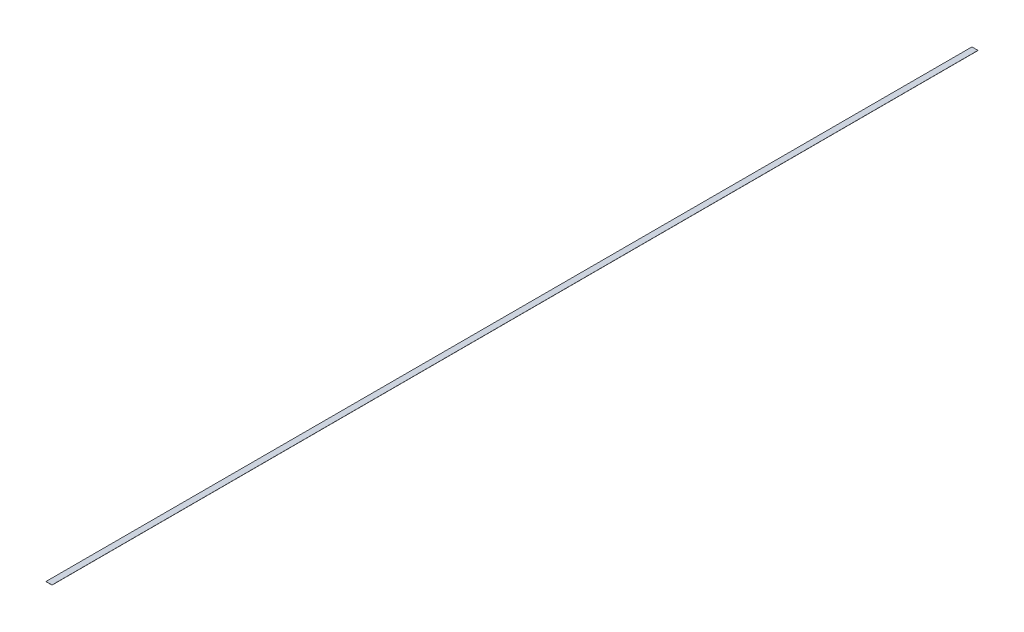
ISO-10303-21;
HEADER;
FILE_DESCRIPTION(('STEP AP214'),'2;1');
FILE_NAME('part.step','',(''),(''),'','','');
FILE_SCHEMA(('AUTOMOTIVE_DESIGN { 1 0 10303 214 1 1 1 1 }'));
ENDSEC;
DATA;
#1=APPLICATION_CONTEXT('core data for automotive mechanical design processes');
#2=APPLICATION_PROTOCOL_DEFINITION('international standard','automotive_design',2000,#1);
#3=PRODUCT_CONTEXT('',#1,'mechanical');
#4=PRODUCT('Part','Part','',(#3));
#5=PRODUCT_RELATED_PRODUCT_CATEGORY('part','',(#4));
#6=PRODUCT_DEFINITION_FORMATION('','',#4);
#7=PRODUCT_DEFINITION_CONTEXT('part definition',#1,'design');
#8=PRODUCT_DEFINITION('design','',#6,#7);
#9=PRODUCT_DEFINITION_SHAPE('','',#8);
#10=(LENGTH_UNIT() NAMED_UNIT(*) SI_UNIT(.MILLI.,.METRE.));
#11=(NAMED_UNIT(*) PLANE_ANGLE_UNIT() SI_UNIT($,.RADIAN.));
#12=(NAMED_UNIT(*) SI_UNIT($,.STERADIAN.) SOLID_ANGLE_UNIT());
#13=UNCERTAINTY_MEASURE_WITH_UNIT(LENGTH_MEASURE(1.E-05),#10,'distance_accuracy_value','');
#14=(GEOMETRIC_REPRESENTATION_CONTEXT(3) GLOBAL_UNCERTAINTY_ASSIGNED_CONTEXT((#13)) GLOBAL_UNIT_ASSIGNED_CONTEXT((#10,
#11,#12)) REPRESENTATION_CONTEXT('',''));
#15=CARTESIAN_POINT('',(0.,0.,0.));
#16=DIRECTION('',(0.,0.,1.));
#17=DIRECTION('',(1.,0.,0.));
#18=AXIS2_PLACEMENT_3D('',#15,#16,#17);
#19=CARTESIAN_POINT('',(0.,0.,0.));
#20=DIRECTION('',(0.,1.,0.));
#21=DIRECTION('',(0.,0.,1.));
#22=AXIS2_PLACEMENT_3D('',#19,#20,#21);
#23=PLANE('',#22);
#24=DIRECTION('',(1.,0.,0.));
#25=VECTOR('',#24,1.);
#26=CARTESIAN_POINT('',(0.,0.,3886.2));
#27=LINE('',#26,#25);
#28=CARTESIAN_POINT('',(-25.4,0.,3886.2));
#29=VERTEX_POINT('',#28);
#30=CARTESIAN_POINT('',(25.4,0.,3886.2));
#31=VERTEX_POINT('',#30);
#32=EDGE_CURVE('E109',#29,#31,#27,.T.);
#33=ORIENTED_EDGE('',*,*,#32,.F.);
#34=DIRECTION('',(0.,0.,-1.));
#35=VECTOR('',#34,1.);
#36=CARTESIAN_POINT('',(-25.4,0.,0.));
#37=LINE('',#36,#35);
#38=CARTESIAN_POINT('',(-25.4,0.,-3886.2));
#39=VERTEX_POINT('',#38);
#40=EDGE_CURVE('E104',#29,#39,#37,.T.);
#41=ORIENTED_EDGE('',*,*,#40,.T.);
#42=DIRECTION('',(1.,0.,0.));
#43=VECTOR('',#42,1.);
#44=CARTESIAN_POINT('',(-25.4,0.,-3886.2));
#45=LINE('',#44,#43);
#46=CARTESIAN_POINT('',(25.4,0.,-3886.2));
#47=VERTEX_POINT('',#46);
#48=EDGE_CURVE('E107',#39,#47,#45,.T.);
#49=ORIENTED_EDGE('',*,*,#48,.T.);
#50=DIRECTION('',(0.,0.,-1.));
#51=VECTOR('',#50,1.);
#52=CARTESIAN_POINT('',(25.4,0.,0.));
#53=LINE('',#52,#51);
#54=EDGE_CURVE('E98',#31,#47,#53,.T.);
#55=ORIENTED_EDGE('',*,*,#54,.F.);
#56=EDGE_LOOP('',(#33,#41,#49,#55));
#57=FACE_BOUND('',#56,.T.);
#58=ADVANCED_FACE('F62',(#57),#23,.F.);
#59=CARTESIAN_POINT('',(25.4,1.27,0.));
#60=DIRECTION('',(-1.,0.,0.));
#61=DIRECTION('',(0.,0.,1.));
#62=AXIS2_PLACEMENT_3D('',#59,#60,#61);
#63=PLANE('',#62);
#64=ORIENTED_EDGE('',*,*,#54,.T.);
#65=DIRECTION('',(0.,-1.,0.));
#66=VECTOR('',#65,1.);
#67=CARTESIAN_POINT('',(25.4,1.27,-3886.2));
#68=LINE('',#67,#66);
#69=CARTESIAN_POINT('',(25.4,1.27,-3886.2));
#70=VERTEX_POINT('',#69);
#71=EDGE_CURVE('E66',#70,#47,#68,.T.);
#72=ORIENTED_EDGE('',*,*,#71,.F.);
#73=DIRECTION('',(0.,0.,-1.));
#74=VECTOR('',#73,1.);
#75=CARTESIAN_POINT('',(25.4,1.27,0.));
#76=LINE('',#75,#74);
#77=CARTESIAN_POINT('',(25.4,1.27,3886.2));
#78=VERTEX_POINT('',#77);
#79=EDGE_CURVE('E128',#78,#70,#76,.T.);
#80=ORIENTED_EDGE('',*,*,#79,.F.);
#81=DIRECTION('',(0.,-1.,0.));
#82=VECTOR('',#81,1.);
#83=CARTESIAN_POINT('',(25.4,1.27,3886.2));
#84=LINE('',#83,#82);
#85=EDGE_CURVE('E12',#78,#31,#84,.T.);
#86=ORIENTED_EDGE('',*,*,#85,.T.);
#87=EDGE_LOOP('',(#64,#72,#80,#86));
#88=FACE_BOUND('',#87,.T.);
#89=ADVANCED_FACE('F136',(#88),#63,.F.);
#90=CARTESIAN_POINT('',(0.,1.27,3886.2));
#91=DIRECTION('',(0.,0.,-1.));
#92=DIRECTION('',(-1.,0.,0.));
#93=AXIS2_PLACEMENT_3D('',#90,#91,#92);
#94=PLANE('',#93);
#95=ORIENTED_EDGE('',*,*,#32,.T.);
#96=ORIENTED_EDGE('',*,*,#85,.F.);
#97=DIRECTION('',(1.,0.,0.));
#98=VECTOR('',#97,1.);
#99=CARTESIAN_POINT('',(0.,1.27,3886.2));
#100=LINE('',#99,#98);
#101=CARTESIAN_POINT('',(-25.4,1.27,3886.2));
#102=VERTEX_POINT('',#101);
#103=EDGE_CURVE('E110',#102,#78,#100,.T.);
#104=ORIENTED_EDGE('',*,*,#103,.F.);
#105=DIRECTION('',(0.,-1.,0.));
#106=VECTOR('',#105,1.);
#107=CARTESIAN_POINT('',(-25.4,1.27,3886.2));
#108=LINE('',#107,#106);
#109=EDGE_CURVE('E72',#102,#29,#108,.T.);
#110=ORIENTED_EDGE('',*,*,#109,.T.);
#111=EDGE_LOOP('',(#95,#96,#104,#110));
#112=FACE_BOUND('',#111,.T.);
#113=ADVANCED_FACE('F135',(#112),#94,.F.);
#114=CARTESIAN_POINT('',(-25.4,1.27,0.));
#115=DIRECTION('',(-1.,0.,0.));
#116=DIRECTION('',(0.,0.,1.));
#117=AXIS2_PLACEMENT_3D('',#114,#115,#116);
#118=PLANE('',#117);
#119=ORIENTED_EDGE('',*,*,#40,.F.);
#120=ORIENTED_EDGE('',*,*,#109,.F.);
#121=DIRECTION('',(0.,0.,-1.));
#122=VECTOR('',#121,1.);
#123=CARTESIAN_POINT('',(-25.4,1.27,0.));
#124=LINE('',#123,#122);
#125=CARTESIAN_POINT('',(-25.4,1.27,-3886.2));
#126=VERTEX_POINT('',#125);
#127=EDGE_CURVE('E116',#102,#126,#124,.T.);
#128=ORIENTED_EDGE('',*,*,#127,.T.);
#129=DIRECTION('',(0.,-1.,0.));
#130=VECTOR('',#129,1.);
#131=CARTESIAN_POINT('',(-25.4,1.27,-3886.2));
#132=LINE('',#131,#130);
#133=EDGE_CURVE('E113',#126,#39,#132,.T.);
#134=ORIENTED_EDGE('',*,*,#133,.T.);
#135=EDGE_LOOP('',(#119,#120,#128,#134));
#136=FACE_BOUND('',#135,.T.);
#137=ADVANCED_FACE('F114',(#136),#118,.T.);
#138=CARTESIAN_POINT('',(0.,1.27,0.));
#139=DIRECTION('',(0.,1.,0.));
#140=DIRECTION('',(0.,0.,1.));
#141=AXIS2_PLACEMENT_3D('',#138,#139,#140);
#142=PLANE('',#141);
#143=ORIENTED_EDGE('',*,*,#103,.T.);
#144=ORIENTED_EDGE('',*,*,#79,.T.);
#145=DIRECTION('',(1.,0.,0.));
#146=VECTOR('',#145,1.);
#147=CARTESIAN_POINT('',(-25.4,1.27,-3886.2));
#148=LINE('',#147,#146);
#149=EDGE_CURVE('E120',#126,#70,#148,.T.);
#150=ORIENTED_EDGE('',*,*,#149,.F.);
#151=ORIENTED_EDGE('',*,*,#127,.F.);
#152=EDGE_LOOP('',(#143,#144,#150,#151));
#153=FACE_BOUND('',#152,.T.);
#154=ADVANCED_FACE('F133',(#153),#142,.T.);
#155=CARTESIAN_POINT('',(-25.4,1.27,-3886.2));
#156=DIRECTION('',(0.,0.,-1.));
#157=DIRECTION('',(-1.,0.,0.));
#158=AXIS2_PLACEMENT_3D('',#155,#156,#157);
#159=PLANE('',#158);
#160=ORIENTED_EDGE('',*,*,#48,.F.);
#161=ORIENTED_EDGE('',*,*,#133,.F.);
#162=ORIENTED_EDGE('',*,*,#149,.T.);
#163=ORIENTED_EDGE('',*,*,#71,.T.);
#164=EDGE_LOOP('',(#160,#161,#162,#163));
#165=FACE_BOUND('',#164,.T.);
#166=ADVANCED_FACE('F64',(#165),#159,.T.);
#167=CLOSED_SHELL('',(#58,#89,#113,#137,#154,#166));
#168=MANIFOLD_SOLID_BREP('B2',#167);
#169=ADVANCED_BREP_SHAPE_REPRESENTATION('',(#18,#168),#14);
#170=SHAPE_DEFINITION_REPRESENTATION(#9,#169);
ENDSEC;
END-ISO-10303-21;
